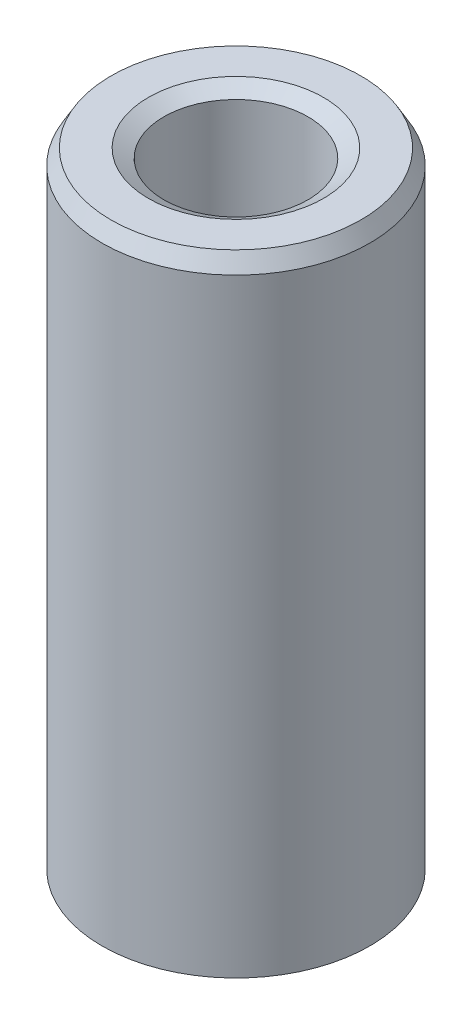
ISO-10303-21;
HEADER;
FILE_DESCRIPTION(('STEP AP214'),'2;1');
FILE_NAME('part.step','',(''),(''),'','','');
FILE_SCHEMA(('AUTOMOTIVE_DESIGN { 1 0 10303 214 1 1 1 1 }'));
ENDSEC;
DATA;
#1=APPLICATION_CONTEXT('core data for automotive mechanical design processes');
#2=APPLICATION_PROTOCOL_DEFINITION('international standard','automotive_design',2000,#1);
#3=PRODUCT_CONTEXT('',#1,'mechanical');
#4=PRODUCT('Part','Part','',(#3));
#5=PRODUCT_RELATED_PRODUCT_CATEGORY('part','',(#4));
#6=PRODUCT_DEFINITION_FORMATION('','',#4);
#7=PRODUCT_DEFINITION_CONTEXT('part definition',#1,'design');
#8=PRODUCT_DEFINITION('design','',#6,#7);
#9=PRODUCT_DEFINITION_SHAPE('','',#8);
#10=(LENGTH_UNIT() NAMED_UNIT(*) SI_UNIT(.MILLI.,.METRE.));
#11=(NAMED_UNIT(*) PLANE_ANGLE_UNIT() SI_UNIT($,.RADIAN.));
#12=(NAMED_UNIT(*) SI_UNIT($,.STERADIAN.) SOLID_ANGLE_UNIT());
#13=UNCERTAINTY_MEASURE_WITH_UNIT(LENGTH_MEASURE(1.E-05),#10,'distance_accuracy_value','');
#14=(GEOMETRIC_REPRESENTATION_CONTEXT(3) GLOBAL_UNCERTAINTY_ASSIGNED_CONTEXT((#13)) GLOBAL_UNIT_ASSIGNED_CONTEXT((#10,
#11,#12)) REPRESENTATION_CONTEXT('',''));
#15=CARTESIAN_POINT('',(0.,0.,0.));
#16=DIRECTION('',(0.,0.,1.));
#17=DIRECTION('',(1.,0.,0.));
#18=AXIS2_PLACEMENT_3D('',#15,#16,#17);
#19=CARTESIAN_POINT('',(0.,141.916776166348,0.));
#20=DIRECTION('',(0.,-1.,0.));
#21=DIRECTION('',(0.,0.,-1.));
#22=AXIS2_PLACEMENT_3D('',#19,#20,#21);
#23=CYLINDRICAL_SURFACE('',#22,30.);
#24=CARTESIAN_POINT('',(0.,2.0115252922995,0.));
#25=DIRECTION('',(0.,1.,0.));
#26=DIRECTION('',(0.,0.,1.));
#27=AXIS2_PLACEMENT_3D('',#24,#25,#26);
#28=CIRCLE('',#27,30.);
#29=CARTESIAN_POINT('',(0.,2.0115252922995,30.));
#30=VERTEX_POINT('',#29);
#31=EDGE_CURVE('E10',#30,#30,#28,.T.);
#32=ORIENTED_EDGE('',*,*,#31,.T.);
#33=EDGE_LOOP('',(#32));
#34=FACE_BOUND('',#33,.T.);
#35=CARTESIAN_POINT('',(0.,138.432712159376,0.));
#36=DIRECTION('',(0.,1.,0.));
#37=DIRECTION('',(0.,0.,1.));
#38=AXIS2_PLACEMENT_3D('',#35,#36,#37);
#39=CIRCLE('',#38,30.);
#40=CARTESIAN_POINT('',(0.,138.432712159376,30.));
#41=VERTEX_POINT('',#40);
#42=EDGE_CURVE('E50',#41,#41,#39,.F.);
#43=ORIENTED_EDGE('',*,*,#42,.T.);
#44=EDGE_LOOP('',(#43));
#45=FACE_BOUND('',#44,.T.);
#46=ADVANCED_FACE('F39',(#34,#45),#23,.T.);
#47=CARTESIAN_POINT('',(0.,141.916776166348,0.));
#48=DIRECTION('',(0.,1.,0.));
#49=DIRECTION('',(0.,0.,1.));
#50=AXIS2_PLACEMENT_3D('',#47,#48,#49);
#51=PLANE('',#50);
#52=CARTESIAN_POINT('',(0.,141.916776166348,0.));
#53=DIRECTION('',(0.,1.,0.));
#54=DIRECTION('',(0.,0.,1.));
#55=AXIS2_PLACEMENT_3D('',#52,#53,#54);
#56=CIRCLE('',#55,19.6267188987666);
#57=CARTESIAN_POINT('',(0.,141.916776166348,19.6267188987666));
#58=VERTEX_POINT('',#57);
#59=EDGE_CURVE('E58',#58,#58,#56,.F.);
#60=ORIENTED_EDGE('',*,*,#59,.T.);
#61=EDGE_LOOP('',(#60));
#62=FACE_BOUND('',#61,.T.);
#63=CARTESIAN_POINT('',(0.,141.916776166348,0.));
#64=DIRECTION('',(0.,1.,0.));
#65=DIRECTION('',(0.,0.,1.));
#66=AXIS2_PLACEMENT_3D('',#63,#64,#65);
#67=CIRCLE('',#66,27.9884747077005);
#68=CARTESIAN_POINT('',(0.,141.916776166348,27.9884747077005));
#69=VERTEX_POINT('',#68);
#70=EDGE_CURVE('E61',#69,#69,#67,.T.);
#71=ORIENTED_EDGE('',*,*,#70,.T.);
#72=EDGE_LOOP('',(#71));
#73=FACE_BOUND('',#72,.T.);
#74=ADVANCED_FACE('F88',(#62,#73),#51,.T.);
#75=CARTESIAN_POINT('',(0.,0.,0.));
#76=DIRECTION('',(0.,1.,0.));
#77=DIRECTION('',(0.,0.,1.));
#78=AXIS2_PLACEMENT_3D('',#75,#76,#77);
#79=PLANE('',#78);
#80=CARTESIAN_POINT('',(0.,0.,0.));
#81=DIRECTION('',(0.,1.,0.));
#82=DIRECTION('',(0.,0.,1.));
#83=AXIS2_PLACEMENT_3D('',#80,#81,#82);
#84=CIRCLE('',#83,18.1541801840936);
#85=CARTESIAN_POINT('',(0.,0.,18.1541801840936));
#86=VERTEX_POINT('',#85);
#87=EDGE_CURVE('E51',#86,#86,#84,.T.);
#88=ORIENTED_EDGE('',*,*,#87,.T.);
#89=EDGE_LOOP('',(#88));
#90=FACE_BOUND('',#89,.T.);
#91=CARTESIAN_POINT('',(0.,0.,0.));
#92=DIRECTION('',(0.,1.,0.));
#93=DIRECTION('',(0.,0.,1.));
#94=AXIS2_PLACEMENT_3D('',#91,#92,#93);
#95=CIRCLE('',#94,26.5159359930274);
#96=CARTESIAN_POINT('',(0.,0.,26.5159359930274));
#97=VERTEX_POINT('',#96);
#98=EDGE_CURVE('E54',#97,#97,#95,.F.);
#99=ORIENTED_EDGE('',*,*,#98,.T.);
#100=EDGE_LOOP('',(#99));
#101=FACE_BOUND('',#100,.T.);
#102=ADVANCED_FACE('F83',(#90,#101),#79,.F.);
#103=CARTESIAN_POINT('',(0.,141.916776166348,0.));
#104=DIRECTION('',(0.,-1.,0.));
#105=DIRECTION('',(0.,0.,-1.));
#106=AXIS2_PLACEMENT_3D('',#103,#104,#105);
#107=CYLINDRICAL_SURFACE('',#106,16.1426548917941);
#108=CARTESIAN_POINT('',(0.,139.905250874049,0.));
#109=DIRECTION('',(0.,1.,0.));
#110=DIRECTION('',(0.,0.,1.));
#111=AXIS2_PLACEMENT_3D('',#108,#109,#110);
#112=CIRCLE('',#111,16.1426548917941);
#113=CARTESIAN_POINT('',(0.,139.905250874049,16.1426548917941));
#114=VERTEX_POINT('',#113);
#115=EDGE_CURVE('E67',#114,#114,#112,.T.);
#116=ORIENTED_EDGE('',*,*,#115,.T.);
#117=EDGE_LOOP('',(#116));
#118=FACE_BOUND('',#117,.T.);
#119=CARTESIAN_POINT('',(0.,3.4840640069726,0.));
#120=DIRECTION('',(0.,1.,0.));
#121=DIRECTION('',(0.,0.,1.));
#122=AXIS2_PLACEMENT_3D('',#119,#120,#121);
#123=CIRCLE('',#122,16.1426548917941);
#124=CARTESIAN_POINT('',(0.,3.4840640069726,16.1426548917941));
#125=VERTEX_POINT('',#124);
#126=EDGE_CURVE('E69',#125,#125,#123,.F.);
#127=ORIENTED_EDGE('',*,*,#126,.T.);
#128=EDGE_LOOP('',(#127));
#129=FACE_BOUND('',#128,.T.);
#130=ADVANCED_FACE('F71',(#118,#129),#107,.F.);
#131=CARTESIAN_POINT('',(0.,139.905250874049,0.));
#132=DIRECTION('',(0.,1.,0.));
#133=DIRECTION('',(0.,0.,1.));
#134=AXIS2_PLACEMENT_3D('',#131,#132,#133);
#135=CONICAL_SURFACE('',#134,16.1426548917941,1.0471975511966);
#136=ORIENTED_EDGE('',*,*,#59,.F.);
#137=EDGE_LOOP('',(#136));
#138=FACE_BOUND('',#137,.T.);
#139=ORIENTED_EDGE('',*,*,#115,.F.);
#140=EDGE_LOOP('',(#139));
#141=FACE_BOUND('',#140,.T.);
#142=ADVANCED_FACE('F77',(#138,#141),#135,.F.);
#143=CARTESIAN_POINT('',(0.,0.,0.));
#144=DIRECTION('',(0.,-1.,0.));
#145=DIRECTION('',(0.,0.,-1.));
#146=AXIS2_PLACEMENT_3D('',#143,#144,#145);
#147=CONICAL_SURFACE('',#146,18.1541801840936,0.523598775598296);
#148=ORIENTED_EDGE('',*,*,#126,.F.);
#149=EDGE_LOOP('',(#148));
#150=FACE_BOUND('',#149,.T.);
#151=ORIENTED_EDGE('',*,*,#87,.F.);
#152=EDGE_LOOP('',(#151));
#153=FACE_BOUND('',#152,.T.);
#154=ADVANCED_FACE('F73',(#150,#153),#147,.F.);
#155=CARTESIAN_POINT('',(0.,2.0115252922995,0.));
#156=DIRECTION('',(0.,1.,0.));
#157=DIRECTION('',(0.,0.,1.));
#158=AXIS2_PLACEMENT_3D('',#155,#156,#157);
#159=CONICAL_SURFACE('',#158,30.,1.0471975511966);
#160=ORIENTED_EDGE('',*,*,#98,.F.);
#161=EDGE_LOOP('',(#160));
#162=FACE_BOUND('',#161,.T.);
#163=ORIENTED_EDGE('',*,*,#31,.F.);
#164=EDGE_LOOP('',(#163));
#165=FACE_BOUND('',#164,.T.);
#166=ADVANCED_FACE('F76',(#162,#165),#159,.T.);
#167=CARTESIAN_POINT('',(0.,141.916776166348,0.));
#168=DIRECTION('',(0.,-1.,0.));
#169=DIRECTION('',(0.,0.,-1.));
#170=AXIS2_PLACEMENT_3D('',#167,#168,#169);
#171=CONICAL_SURFACE('',#170,27.9884747077005,0.523598775598293);
#172=ORIENTED_EDGE('',*,*,#42,.F.);
#173=EDGE_LOOP('',(#172));
#174=FACE_BOUND('',#173,.T.);
#175=ORIENTED_EDGE('',*,*,#70,.F.);
#176=EDGE_LOOP('',(#175));
#177=FACE_BOUND('',#176,.T.);
#178=ADVANCED_FACE('F45',(#174,#177),#171,.T.);
#179=CLOSED_SHELL('',(#46,#74,#102,#130,#142,#154,#166,#178));
#180=MANIFOLD_SOLID_BREP('B2',#179);
#181=ADVANCED_BREP_SHAPE_REPRESENTATION('',(#18,#180),#14);
#182=SHAPE_DEFINITION_REPRESENTATION(#9,#181);
ENDSEC;
END-ISO-10303-21;
